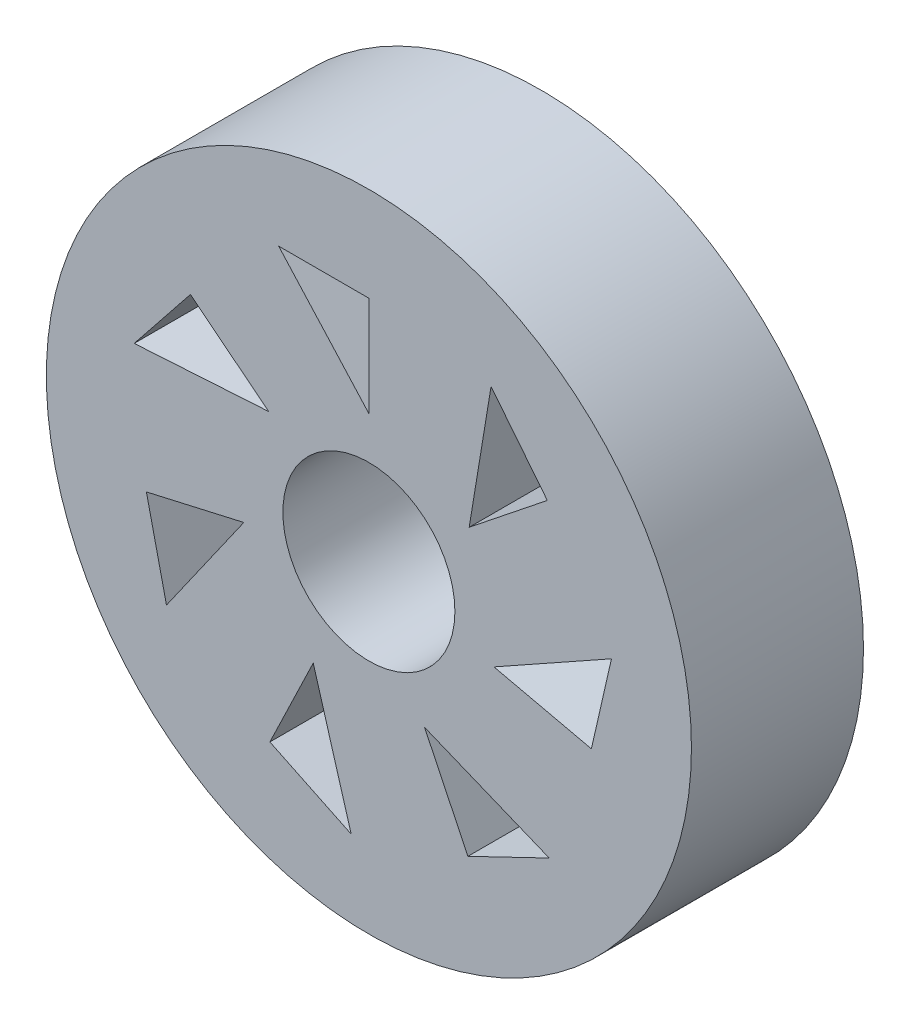
ISO-10303-21;
HEADER;
FILE_DESCRIPTION(('STEP AP214'),'2;1');
FILE_NAME('part.step','',(''),(''),'','','');
FILE_SCHEMA(('AUTOMOTIVE_DESIGN { 1 0 10303 214 1 1 1 1 }'));
ENDSEC;
DATA;
#1=APPLICATION_CONTEXT('core data for automotive mechanical design processes');
#2=APPLICATION_PROTOCOL_DEFINITION('international standard','automotive_design',2000,#1);
#3=PRODUCT_CONTEXT('',#1,'mechanical');
#4=PRODUCT('Part','Part','',(#3));
#5=PRODUCT_RELATED_PRODUCT_CATEGORY('part','',(#4));
#6=PRODUCT_DEFINITION_FORMATION('','',#4);
#7=PRODUCT_DEFINITION_CONTEXT('part definition',#1,'design');
#8=PRODUCT_DEFINITION('design','',#6,#7);
#9=PRODUCT_DEFINITION_SHAPE('','',#8);
#10=(LENGTH_UNIT() NAMED_UNIT(*) SI_UNIT(.MILLI.,.METRE.));
#11=(NAMED_UNIT(*) PLANE_ANGLE_UNIT() SI_UNIT($,.RADIAN.));
#12=(NAMED_UNIT(*) SI_UNIT($,.STERADIAN.) SOLID_ANGLE_UNIT());
#13=UNCERTAINTY_MEASURE_WITH_UNIT(LENGTH_MEASURE(1.E-05),#10,'distance_accuracy_value','');
#14=(GEOMETRIC_REPRESENTATION_CONTEXT(3) GLOBAL_UNCERTAINTY_ASSIGNED_CONTEXT((#13)) GLOBAL_UNIT_ASSIGNED_CONTEXT((#10,
#11,#12)) REPRESENTATION_CONTEXT('',''));
#15=CARTESIAN_POINT('',(0.,0.,0.));
#16=DIRECTION('',(0.,0.,1.));
#17=DIRECTION('',(1.,0.,0.));
#18=AXIS2_PLACEMENT_3D('',#15,#16,#17);
#19=CARTESIAN_POINT('',(-23.0042047893042,15.6099961070278,10.16));
#20=DIRECTION('',(0.,0.,1.));
#21=DIRECTION('',(1.,0.,0.));
#22=AXIS2_PLACEMENT_3D('',#19,#20,#21);
#23=PLANE('',#22);
#24=DIRECTION('',(0.998116427210059,0.0613481681342384,0.));
#25=VECTOR('',#24,1.);
#26=CARTESIAN_POINT('',(-28.9279019001569,20.3339869167322,10.16));
#27=LINE('',#26,#25);
#28=CARTESIAN_POINT('',(-36.8652069697175,19.8461288746586,10.16));
#29=VERTEX_POINT('',#28);
#30=CARTESIAN_POINT('',(-28.9279019001569,20.3339869167325,10.16));
#31=VERTEX_POINT('',#30);
#32=EDGE_CURVE('E71',#29,#31,#27,.T.);
#33=ORIENTED_EDGE('',*,*,#32,.F.);
#34=DIRECTION('',(-0.623489801858733,-0.78183148246803,0.));
#35=VECTOR('',#34,1.);
#36=CARTESIAN_POINT('',(-36.8652069697175,19.8461288746586,10.16));
#37=LINE('',#36,#35);
#38=CARTESIAN_POINT('',(-33.5418494923247,24.013487339184,10.16));
#39=VERTEX_POINT('',#38);
#40=EDGE_CURVE('E379',#39,#29,#37,.T.);
#41=ORIENTED_EDGE('',*,*,#40,.F.);
#42=DIRECTION('',(-0.78183148246803,0.623489801858733,0.));
#43=VECTOR('',#42,1.);
#44=CARTESIAN_POINT('',(-33.5418494923247,24.013487339184,10.16));
#45=LINE('',#44,#43);
#46=EDGE_CURVE('E390',#31,#39,#45,.T.);
#47=ORIENTED_EDGE('',*,*,#46,.F.);
#48=EDGE_LOOP('',(#33,#41,#47));
#49=FACE_BOUND('',#48,.T.);
#50=DIRECTION('',(0.574351484194065,0.818608803155741,0.));
#51=VECTOR('',#50,1.);
#52=CARTESIAN_POINT('',(-30.3909342651372,13.9240233070828,10.16));
#53=LINE('',#52,#51);
#54=CARTESIAN_POINT('',(-34.9583402539816,7.41421380375968,10.16));
#55=VERTEX_POINT('',#54);
#56=CARTESIAN_POINT('',(-30.3909342651372,13.9240233070837,10.16));
#57=VERTEX_POINT('',#56);
#58=EDGE_CURVE('E79',#55,#57,#53,.T.);
#59=ORIENTED_EDGE('',*,*,#58,.F.);
#60=DIRECTION('',(0.222520933956306,-0.974927912181826,0.));
#61=VECTOR('',#60,1.);
#62=CARTESIAN_POINT('',(-34.9583402539816,7.41421380375968,10.16));
#63=LINE('',#62,#61);
#64=CARTESIAN_POINT('',(-36.1444328051917,12.6108248104022,10.16));
#65=VERTEX_POINT('',#64);
#66=EDGE_CURVE('E348',#65,#55,#63,.T.);
#67=ORIENTED_EDGE('',*,*,#66,.F.);
#68=DIRECTION('',(-0.974927912181826,-0.222520933956305,0.));
#69=VECTOR('',#68,1.);
#70=CARTESIAN_POINT('',(-36.1444328051917,12.6108248104022,10.16));
#71=LINE('',#70,#69);
#72=EDGE_CURVE('E359',#57,#65,#71,.T.);
#73=ORIENTED_EDGE('',*,*,#72,.F.);
#74=EDGE_LOOP('',(#59,#67,#73));
#75=FACE_BOUND('',#74,.T.);
#76=DIRECTION('',(-0.281911841055207,0.959440312824546,0.));
#77=VECTOR('',#76,1.);
#78=CARTESIAN_POINT('',(-26.2916086729933,8.78363160336959,10.16));
#79=LINE('',#78,#77);
#80=CARTESIAN_POINT('',(-24.0497657134187,1.15388997071297,10.16));
#81=VERTEX_POINT('',#80);
#82=CARTESIAN_POINT('',(-26.2916086729947,8.78363160336959,10.16));
#83=VERTEX_POINT('',#82);
#84=EDGE_CURVE('E324',#81,#83,#79,.T.);
#85=ORIENTED_EDGE('',*,*,#84,.F.);
#86=DIRECTION('',(0.900968867902416,-0.433883739117565,0.));
#87=VECTOR('',#86,1.);
#88=CARTESIAN_POINT('',(-24.0497657134187,1.15388997071297,10.16));
#89=LINE('',#88,#87);
#90=CARTESIAN_POINT('',(-28.8521564102918,3.46659943992451,10.16));
#91=VERTEX_POINT('',#90);
#92=EDGE_CURVE('E315',#91,#81,#89,.T.);
#93=ORIENTED_EDGE('',*,*,#92,.F.);
#94=DIRECTION('',(-0.433883739117565,-0.900968867902416,0.));
#95=VECTOR('',#94,1.);
#96=CARTESIAN_POINT('',(-28.8521564102918,3.46659943992451,10.16));
#97=LINE('',#96,#95);
#98=EDGE_CURVE('E327',#83,#91,#97,.T.);
#99=ORIENTED_EDGE('',*,*,#98,.F.);
#100=EDGE_LOOP('',(#85,#93,#99));
#101=FACE_BOUND('',#100,.T.);
#102=DIRECTION('',(-0.925889800036348,0.377793697920772,0.));
#103=VECTOR('',#102,1.);
#104=CARTESIAN_POINT('',(-19.7168009056126,8.7836316033701,10.16));
#105=LINE('',#104,#103);
#106=CARTESIAN_POINT('',(-12.3538624714411,5.77930890913646,10.16));
#107=VERTEX_POINT('',#106);
#108=CARTESIAN_POINT('',(-19.716800905614,8.7836316033701,10.16));
#109=VERTEX_POINT('',#108);
#110=EDGE_CURVE('E291',#107,#109,#105,.T.);
#111=ORIENTED_EDGE('',*,*,#110,.F.);
#112=DIRECTION('',(0.900968867902422,0.433883739117553,0.));
#113=VECTOR('',#112,1.);
#114=CARTESIAN_POINT('',(-12.3538624714411,5.77930890913646,10.16));
#115=LINE('',#114,#113);
#116=CARTESIAN_POINT('',(-17.1562531683142,3.46659943992498,10.16));
#117=VERTEX_POINT('',#116);
#118=EDGE_CURVE('E282',#117,#107,#115,.T.);
#119=ORIENTED_EDGE('',*,*,#118,.F.);
#120=DIRECTION('',(0.433883739117553,-0.900968867902422,0.));
#121=VECTOR('',#120,1.);
#122=CARTESIAN_POINT('',(-17.1562531683142,3.46659943992498,10.16));
#123=LINE('',#122,#121);
#124=EDGE_CURVE('E294',#109,#117,#123,.T.);
#125=ORIENTED_EDGE('',*,*,#124,.F.);
#126=EDGE_LOOP('',(#111,#119,#125));
#127=FACE_BOUND('',#126,.T.);
#128=DIRECTION('',(-0.87265385488016,-0.488339277104347,0.));
#129=VECTOR('',#128,1.);
#130=CARTESIAN_POINT('',(-15.6174753134696,13.924023307084,10.16));
#131=LINE('',#130,#129);
#132=CARTESIAN_POINT('',(-8.67788422220488,17.8074358170458,10.16));
#133=VERTEX_POINT('',#132);
#134=CARTESIAN_POINT('',(-15.6174753134696,13.9240233070832,10.16));
#135=VERTEX_POINT('',#134);
#136=EDGE_CURVE('E258',#133,#135,#131,.T.);
#137=ORIENTED_EDGE('',*,*,#136,.F.);
#138=DIRECTION('',(0.222520933956319,0.974927912181823,0.));
#139=VECTOR('',#138,1.);
#140=CARTESIAN_POINT('',(-8.67788422220488,17.8074358170458,10.16));
#141=LINE('',#140,#139);
#142=CARTESIAN_POINT('',(-9.86397677341508,12.6108248104033,10.16));
#143=VERTEX_POINT('',#142);
#144=EDGE_CURVE('E249',#143,#133,#141,.T.);
#145=ORIENTED_EDGE('',*,*,#144,.F.);
#146=DIRECTION('',(0.974927912181823,-0.222520933956318,0.));
#147=VECTOR('',#146,1.);
#148=CARTESIAN_POINT('',(-9.86397677341508,12.6108248104033,10.16));
#149=LINE('',#148,#147);
#150=EDGE_CURVE('E261',#135,#143,#149,.T.);
#151=ORIENTED_EDGE('',*,*,#150,.F.);
#152=EDGE_LOOP('',(#137,#145,#151));
#153=FACE_BOUND('',#152,.T.);
#154=DIRECTION('',(-0.162291758104631,-0.986742816164023,0.));
#155=VECTOR('',#154,1.);
#156=CARTESIAN_POINT('',(-17.0805076784509,20.3339869167332,10.16));
#157=LINE('',#156,#155);
#158=CARTESIAN_POINT('',(-15.789917563676,28.1808458037104,10.16));
#159=VERTEX_POINT('',#158);
#160=CARTESIAN_POINT('',(-17.0805076784509,20.3339869167329,10.16));
#161=VERTEX_POINT('',#160);
#162=EDGE_CURVE('E206',#159,#161,#157,.T.);
#163=ORIENTED_EDGE('',*,*,#162,.F.);
#164=DIRECTION('',(-0.623489801858731,0.781831482468031,0.));
#165=VECTOR('',#164,1.);
#166=CARTESIAN_POINT('',(-15.789917563676,28.1808458037104,10.16));
#167=LINE('',#166,#165);
#168=CARTESIAN_POINT('',(-12.4665600862831,24.013487339185,10.16));
#169=VERTEX_POINT('',#168);
#170=EDGE_CURVE('E224',#169,#159,#167,.T.);
#171=ORIENTED_EDGE('',*,*,#170,.F.);
#172=DIRECTION('',(0.781831482468032,0.623489801858731,0.));
#173=VECTOR('',#172,1.);
#174=CARTESIAN_POINT('',(-12.4665600862831,24.013487339185,10.16));
#175=LINE('',#174,#173);
#176=EDGE_CURVE('E228',#161,#169,#175,.T.);
#177=ORIENTED_EDGE('',*,*,#176,.F.);
#178=EDGE_LOOP('',(#163,#171,#177));
#179=FACE_BOUND('',#178,.T.);
#180=DIRECTION('',(0.,1.,0.));
#181=VECTOR('',#180,1.);
#182=CARTESIAN_POINT('',(-23.0042047893042,29.0881495701709,10.16));
#183=LINE('',#182,#181);
#184=CARTESIAN_POINT('',(-23.0042047893042,23.186689094823,10.16));
#185=VERTEX_POINT('',#184);
#186=CARTESIAN_POINT('',(-23.0042047893042,29.0881495701709,10.16));
#187=VERTEX_POINT('',#186);
#188=EDGE_CURVE('E241',#185,#187,#183,.T.);
#189=ORIENTED_EDGE('',*,*,#188,.F.);
#190=DIRECTION('',(0.670279342672237,-0.742108888766921,0.));
#191=VECTOR('',#190,1.);
#192=CARTESIAN_POINT('',(-23.0042047893042,23.186689094823,10.16));
#193=LINE('',#192,#191);
#194=CARTESIAN_POINT('',(-28.3344563306851,29.0881495701709,10.16));
#195=VERTEX_POINT('',#194);
#196=EDGE_CURVE('E409',#195,#185,#193,.T.);
#197=ORIENTED_EDGE('',*,*,#196,.F.);
#198=DIRECTION('',(-1.,0.,0.));
#199=VECTOR('',#198,1.);
#200=CARTESIAN_POINT('',(-28.3344563306851,29.0881495701709,10.16));
#201=LINE('',#200,#199);
#202=EDGE_CURVE('E420',#187,#195,#201,.T.);
#203=ORIENTED_EDGE('',*,*,#202,.F.);
#204=EDGE_LOOP('',(#189,#197,#203));
#205=FACE_BOUND('',#204,.T.);
#206=CARTESIAN_POINT('',(-23.0042047893042,15.6099961070278,10.16));
#207=DIRECTION('',(0.,0.,1.));
#208=DIRECTION('',(1.,0.,0.));
#209=AXIS2_PLACEMENT_3D('',#206,#207,#208);
#210=CIRCLE('',#209,19.05);
#211=CARTESIAN_POINT('',(-3.95420478930416,15.6099961070278,10.16));
#212=VERTEX_POINT('',#211);
#213=EDGE_CURVE('E13',#212,#212,#210,.T.);
#214=ORIENTED_EDGE('',*,*,#213,.T.);
#215=EDGE_LOOP('',(#214));
#216=FACE_BOUND('',#215,.T.);
#217=CARTESIAN_POINT('',(-23.0042047893042,15.6099961070278,10.16));
#218=DIRECTION('',(0.,0.,1.));
#219=DIRECTION('',(1.,0.,0.));
#220=AXIS2_PLACEMENT_3D('',#217,#218,#219);
#221=CIRCLE('',#220,5.08);
#222=CARTESIAN_POINT('',(-17.9242047893042,15.6099961070278,10.16));
#223=VERTEX_POINT('',#222);
#224=EDGE_CURVE('E437',#223,#223,#221,.T.);
#225=ORIENTED_EDGE('',*,*,#224,.F.);
#226=EDGE_LOOP('',(#225));
#227=FACE_BOUND('',#226,.T.);
#228=ADVANCED_FACE('F55',(#49,#75,#101,#127,#153,#179,#205,#216,#227),#23,.T.);
#229=CARTESIAN_POINT('',(-23.0042047893042,15.6099961070278,0.));
#230=DIRECTION('',(0.,0.,1.));
#231=DIRECTION('',(1.,0.,0.));
#232=AXIS2_PLACEMENT_3D('',#229,#230,#231);
#233=PLANE('',#232);
#234=DIRECTION('',(-0.623489801858733,-0.78183148246803,0.));
#235=VECTOR('',#234,1.);
#236=CARTESIAN_POINT('',(-36.8652069697175,19.8461288746586,0.));
#237=LINE('',#236,#235);
#238=CARTESIAN_POINT('',(-33.5418494923247,24.0134873391843,0.));
#239=VERTEX_POINT('',#238);
#240=CARTESIAN_POINT('',(-36.8652069697175,19.8461288746586,0.));
#241=VERTEX_POINT('',#240);
#242=EDGE_CURVE('E383',#239,#241,#237,.T.);
#243=ORIENTED_EDGE('',*,*,#242,.T.);
#244=DIRECTION('',(0.998116427210059,0.0613481681342384,0.));
#245=VECTOR('',#244,1.);
#246=CARTESIAN_POINT('',(-28.9279019001569,20.3339869167322,0.));
#247=LINE('',#246,#245);
#248=CARTESIAN_POINT('',(-28.9279019001569,20.3339869167322,0.));
#249=VERTEX_POINT('',#248);
#250=EDGE_CURVE('E374',#241,#249,#247,.T.);
#251=ORIENTED_EDGE('',*,*,#250,.T.);
#252=DIRECTION('',(-0.78183148246803,0.623489801858733,0.));
#253=VECTOR('',#252,1.);
#254=CARTESIAN_POINT('',(-33.5418494923247,24.013487339184,0.));
#255=LINE('',#254,#253);
#256=EDGE_CURVE('E378',#249,#239,#255,.T.);
#257=ORIENTED_EDGE('',*,*,#256,.T.);
#258=EDGE_LOOP('',(#243,#251,#257));
#259=FACE_BOUND('',#258,.T.);
#260=DIRECTION('',(0.222520933956306,-0.974927912181826,0.));
#261=VECTOR('',#260,1.);
#262=CARTESIAN_POINT('',(-34.9583402539816,7.41421380375968,0.));
#263=LINE('',#262,#261);
#264=CARTESIAN_POINT('',(-36.1444328051917,12.610824810403,0.));
#265=VERTEX_POINT('',#264);
#266=CARTESIAN_POINT('',(-34.9583402539816,7.41421380375968,0.));
#267=VERTEX_POINT('',#266);
#268=EDGE_CURVE('E352',#265,#267,#263,.T.);
#269=ORIENTED_EDGE('',*,*,#268,.T.);
#270=DIRECTION('',(0.574351484194065,0.818608803155741,0.));
#271=VECTOR('',#270,1.);
#272=CARTESIAN_POINT('',(-30.3909342651372,13.9240233070828,0.));
#273=LINE('',#272,#271);
#274=CARTESIAN_POINT('',(-30.3909342651372,13.9240233070828,0.));
#275=VERTEX_POINT('',#274);
#276=EDGE_CURVE('E343',#267,#275,#273,.T.);
#277=ORIENTED_EDGE('',*,*,#276,.T.);
#278=DIRECTION('',(-0.974927912181826,-0.222520933956305,0.));
#279=VECTOR('',#278,1.);
#280=CARTESIAN_POINT('',(-36.1444328051917,12.6108248104022,0.));
#281=LINE('',#280,#279);
#282=EDGE_CURVE('E347',#275,#265,#281,.T.);
#283=ORIENTED_EDGE('',*,*,#282,.T.);
#284=EDGE_LOOP('',(#269,#277,#283));
#285=FACE_BOUND('',#284,.T.);
#286=DIRECTION('',(0.900968867902416,-0.433883739117565,0.));
#287=VECTOR('',#286,1.);
#288=CARTESIAN_POINT('',(-24.0497657134187,1.15388997071297,0.));
#289=LINE('',#288,#287);
#290=CARTESIAN_POINT('',(-28.8521564102932,3.46659943992451,0.));
#291=VERTEX_POINT('',#290);
#292=CARTESIAN_POINT('',(-24.0497657134187,1.15388997071297,0.));
#293=VERTEX_POINT('',#292);
#294=EDGE_CURVE('E319',#291,#293,#289,.T.);
#295=ORIENTED_EDGE('',*,*,#294,.T.);
#296=DIRECTION('',(-0.281911841055207,0.959440312824546,0.));
#297=VECTOR('',#296,1.);
#298=CARTESIAN_POINT('',(-26.2916086729933,8.78363160336959,0.));
#299=LINE('',#298,#297);
#300=CARTESIAN_POINT('',(-26.2916086729933,8.78363160336959,0.));
#301=VERTEX_POINT('',#300);
#302=EDGE_CURVE('E310',#293,#301,#299,.T.);
#303=ORIENTED_EDGE('',*,*,#302,.T.);
#304=DIRECTION('',(-0.433883739117565,-0.900968867902416,0.));
#305=VECTOR('',#304,1.);
#306=CARTESIAN_POINT('',(-28.8521564102918,3.46659943992451,0.));
#307=LINE('',#306,#305);
#308=EDGE_CURVE('E314',#301,#291,#307,.T.);
#309=ORIENTED_EDGE('',*,*,#308,.T.);
#310=EDGE_LOOP('',(#295,#303,#309));
#311=FACE_BOUND('',#310,.T.);
#312=DIRECTION('',(0.900968867902422,0.433883739117553,0.));
#313=VECTOR('',#312,1.);
#314=CARTESIAN_POINT('',(-12.3538624714411,5.77930890913646,0.));
#315=LINE('',#314,#313);
#316=CARTESIAN_POINT('',(-17.1562531683156,3.46659943992498,0.));
#317=VERTEX_POINT('',#316);
#318=CARTESIAN_POINT('',(-12.3538624714411,5.77930890913646,0.));
#319=VERTEX_POINT('',#318);
#320=EDGE_CURVE('E286',#317,#319,#315,.T.);
#321=ORIENTED_EDGE('',*,*,#320,.T.);
#322=DIRECTION('',(-0.925889800036348,0.377793697920772,0.));
#323=VECTOR('',#322,1.);
#324=CARTESIAN_POINT('',(-19.7168009056126,8.7836316033701,0.));
#325=LINE('',#324,#323);
#326=CARTESIAN_POINT('',(-19.7168009056126,8.7836316033701,0.));
#327=VERTEX_POINT('',#326);
#328=EDGE_CURVE('E277',#319,#327,#325,.T.);
#329=ORIENTED_EDGE('',*,*,#328,.T.);
#330=DIRECTION('',(0.433883739117553,-0.900968867902422,0.));
#331=VECTOR('',#330,1.);
#332=CARTESIAN_POINT('',(-17.1562531683142,3.46659943992498,0.));
#333=LINE('',#332,#331);
#334=EDGE_CURVE('E281',#327,#317,#333,.T.);
#335=ORIENTED_EDGE('',*,*,#334,.T.);
#336=EDGE_LOOP('',(#321,#329,#335));
#337=FACE_BOUND('',#336,.T.);
#338=DIRECTION('',(0.222520933956319,0.974927912181823,0.));
#339=VECTOR('',#338,1.);
#340=CARTESIAN_POINT('',(-8.67788422220488,17.8074358170458,0.));
#341=LINE('',#340,#339);
#342=CARTESIAN_POINT('',(-9.86397677341508,12.6108248104025,0.));
#343=VERTEX_POINT('',#342);
#344=CARTESIAN_POINT('',(-8.67788422220488,17.8074358170458,0.));
#345=VERTEX_POINT('',#344);
#346=EDGE_CURVE('E253',#343,#345,#341,.T.);
#347=ORIENTED_EDGE('',*,*,#346,.T.);
#348=DIRECTION('',(-0.87265385488016,-0.488339277104347,0.));
#349=VECTOR('',#348,1.);
#350=CARTESIAN_POINT('',(-15.6174753134696,13.924023307084,0.));
#351=LINE('',#350,#349);
#352=CARTESIAN_POINT('',(-15.6174753134696,13.924023307084,0.));
#353=VERTEX_POINT('',#352);
#354=EDGE_CURVE('E244',#345,#353,#351,.T.);
#355=ORIENTED_EDGE('',*,*,#354,.T.);
#356=DIRECTION('',(0.974927912181823,-0.222520933956318,0.));
#357=VECTOR('',#356,1.);
#358=CARTESIAN_POINT('',(-9.86397677341508,12.6108248104033,0.));
#359=LINE('',#358,#357);
#360=EDGE_CURVE('E248',#353,#343,#359,.T.);
#361=ORIENTED_EDGE('',*,*,#360,.T.);
#362=EDGE_LOOP('',(#347,#355,#361));
#363=FACE_BOUND('',#362,.T.);
#364=DIRECTION('',(-0.623489801858731,0.781831482468031,0.));
#365=VECTOR('',#364,1.);
#366=CARTESIAN_POINT('',(-15.789917563676,28.1808458037104,0.));
#367=LINE('',#366,#365);
#368=CARTESIAN_POINT('',(-12.4665600862831,24.0134873391847,0.));
#369=VERTEX_POINT('',#368);
#370=CARTESIAN_POINT('',(-15.789917563676,28.1808458037104,0.));
#371=VERTEX_POINT('',#370);
#372=EDGE_CURVE('E212',#369,#371,#367,.T.);
#373=ORIENTED_EDGE('',*,*,#372,.T.);
#374=DIRECTION('',(-0.162291758104631,-0.986742816164023,0.));
#375=VECTOR('',#374,1.);
#376=CARTESIAN_POINT('',(-17.0805076784509,20.3339869167332,0.));
#377=LINE('',#376,#375);
#378=CARTESIAN_POINT('',(-17.0805076784509,20.3339869167332,0.));
#379=VERTEX_POINT('',#378);
#380=EDGE_CURVE('E203',#371,#379,#377,.T.);
#381=ORIENTED_EDGE('',*,*,#380,.T.);
#382=DIRECTION('',(0.781831482468032,0.623489801858731,0.));
#383=VECTOR('',#382,1.);
#384=CARTESIAN_POINT('',(-12.4665600862831,24.013487339185,0.));
#385=LINE('',#384,#383);
#386=EDGE_CURVE('E216',#379,#369,#385,.T.);
#387=ORIENTED_EDGE('',*,*,#386,.T.);
#388=EDGE_LOOP('',(#373,#381,#387));
#389=FACE_BOUND('',#388,.T.);
#390=DIRECTION('',(0.670279342672237,-0.742108888766921,0.));
#391=VECTOR('',#390,1.);
#392=CARTESIAN_POINT('',(-23.0042047893042,23.186689094823,0.));
#393=LINE('',#392,#391);
#394=CARTESIAN_POINT('',(-28.3344563306851,29.0881495701709,0.));
#395=VERTEX_POINT('',#394);
#396=CARTESIAN_POINT('',(-23.0042047893042,23.186689094823,0.));
#397=VERTEX_POINT('',#396);
#398=EDGE_CURVE('E413',#395,#397,#393,.T.);
#399=ORIENTED_EDGE('',*,*,#398,.T.);
#400=DIRECTION('',(0.,1.,0.));
#401=VECTOR('',#400,1.);
#402=CARTESIAN_POINT('',(-23.0042047893042,29.0881495701709,0.));
#403=LINE('',#402,#401);
#404=CARTESIAN_POINT('',(-23.0042047893042,29.0881495701709,0.));
#405=VERTEX_POINT('',#404);
#406=EDGE_CURVE('E404',#397,#405,#403,.T.);
#407=ORIENTED_EDGE('',*,*,#406,.T.);
#408=DIRECTION('',(-1.,0.,0.));
#409=VECTOR('',#408,1.);
#410=CARTESIAN_POINT('',(-28.3344563306851,29.0881495701709,0.));
#411=LINE('',#410,#409);
#412=EDGE_CURVE('E408',#405,#395,#411,.T.);
#413=ORIENTED_EDGE('',*,*,#412,.T.);
#414=EDGE_LOOP('',(#399,#407,#413));
#415=FACE_BOUND('',#414,.T.);
#416=CARTESIAN_POINT('',(-23.0042047893042,15.6099961070278,0.));
#417=DIRECTION('',(0.,0.,1.));
#418=DIRECTION('',(1.,0.,0.));
#419=AXIS2_PLACEMENT_3D('',#416,#417,#418);
#420=CIRCLE('',#419,19.05);
#421=CARTESIAN_POINT('',(-3.95420478930416,15.6099961070278,0.));
#422=VERTEX_POINT('',#421);
#423=EDGE_CURVE('E59',#422,#422,#420,.T.);
#424=ORIENTED_EDGE('',*,*,#423,.F.);
#425=EDGE_LOOP('',(#424));
#426=FACE_BOUND('',#425,.T.);
#427=CARTESIAN_POINT('',(-23.0042047893042,15.6099961070278,0.));
#428=DIRECTION('',(0.,0.,1.));
#429=DIRECTION('',(1.,0.,0.));
#430=AXIS2_PLACEMENT_3D('',#427,#428,#429);
#431=CIRCLE('',#430,5.08);
#432=CARTESIAN_POINT('',(-17.9242047893042,15.6099961070278,0.));
#433=VERTEX_POINT('',#432);
#434=EDGE_CURVE('E430',#433,#433,#431,.T.);
#435=ORIENTED_EDGE('',*,*,#434,.T.);
#436=EDGE_LOOP('',(#435));
#437=FACE_BOUND('',#436,.T.);
#438=ADVANCED_FACE('F221',(#259,#285,#311,#337,#363,#389,#415,#426,#437),#233,.F.);
#439=CARTESIAN_POINT('',(-23.0042047893042,15.6099961070278,10.16));
#440=DIRECTION('',(0.,0.,-1.));
#441=DIRECTION('',(-1.,0.,0.));
#442=AXIS2_PLACEMENT_3D('',#439,#440,#441);
#443=CYLINDRICAL_SURFACE('',#442,19.05);
#444=ORIENTED_EDGE('',*,*,#213,.F.);
#445=EDGE_LOOP('',(#444));
#446=FACE_BOUND('',#445,.T.);
#447=ORIENTED_EDGE('',*,*,#423,.T.);
#448=EDGE_LOOP('',(#447));
#449=FACE_BOUND('',#448,.T.);
#450=ADVANCED_FACE('F57',(#446,#449),#443,.T.);
#451=CARTESIAN_POINT('',(-23.0042047893042,15.6099961070278,10.16));
#452=DIRECTION('',(0.,0.,-1.));
#453=DIRECTION('',(-1.,0.,0.));
#454=AXIS2_PLACEMENT_3D('',#451,#452,#453);
#455=CYLINDRICAL_SURFACE('',#454,5.08);
#456=ORIENTED_EDGE('',*,*,#224,.T.);
#457=EDGE_LOOP('',(#456));
#458=FACE_BOUND('',#457,.T.);
#459=ORIENTED_EDGE('',*,*,#434,.F.);
#460=EDGE_LOOP('',(#459));
#461=FACE_BOUND('',#460,.T.);
#462=ADVANCED_FACE('F446',(#458,#461),#455,.F.);
#463=CARTESIAN_POINT('',(-23.0042047893042,29.0881495701709,0.));
#464=DIRECTION('',(1.,0.,0.));
#465=DIRECTION('',(0.,0.,-1.));
#466=AXIS2_PLACEMENT_3D('',#463,#464,#465);
#467=PLANE('',#466);
#468=ORIENTED_EDGE('',*,*,#188,.T.);
#469=DIRECTION('',(0.,0.,1.));
#470=VECTOR('',#469,1.);
#471=CARTESIAN_POINT('',(-23.0042047893042,29.0881495701709,0.));
#472=LINE('',#471,#470);
#473=EDGE_CURVE('E417',#405,#187,#472,.T.);
#474=ORIENTED_EDGE('',*,*,#473,.F.);
#475=ORIENTED_EDGE('',*,*,#406,.F.);
#476=DIRECTION('',(0.,0.,1.));
#477=VECTOR('',#476,1.);
#478=CARTESIAN_POINT('',(-23.0042047893042,23.186689094823,0.));
#479=LINE('',#478,#477);
#480=EDGE_CURVE('E427',#397,#185,#479,.T.);
#481=ORIENTED_EDGE('',*,*,#480,.T.);
#482=EDGE_LOOP('',(#468,#474,#475,#481));
#483=FACE_BOUND('',#482,.T.);
#484=ADVANCED_FACE('F448',(#483),#467,.F.);
#485=CARTESIAN_POINT('',(-23.0042047893042,23.186689094823,0.));
#486=DIRECTION('',(-0.742108888766921,-0.670279342672237,0.));
#487=DIRECTION('',(0.670279342672237,-0.742108888766921,0.));
#488=AXIS2_PLACEMENT_3D('',#485,#486,#487);
#489=PLANE('',#488);
#490=ORIENTED_EDGE('',*,*,#196,.T.);
#491=ORIENTED_EDGE('',*,*,#480,.F.);
#492=ORIENTED_EDGE('',*,*,#398,.F.);
#493=DIRECTION('',(0.,0.,1.));
#494=VECTOR('',#493,1.);
#495=CARTESIAN_POINT('',(-28.3344563306851,29.0881495701709,0.));
#496=LINE('',#495,#494);
#497=EDGE_CURVE('E431',#395,#195,#496,.T.);
#498=ORIENTED_EDGE('',*,*,#497,.T.);
#499=EDGE_LOOP('',(#490,#491,#492,#498));
#500=FACE_BOUND('',#499,.T.);
#501=ADVANCED_FACE('F455',(#500),#489,.F.);
#502=CARTESIAN_POINT('',(-28.3344563306851,29.0881495701709,0.));
#503=DIRECTION('',(0.,1.,0.));
#504=DIRECTION('',(0.,0.,1.));
#505=AXIS2_PLACEMENT_3D('',#502,#503,#504);
#506=PLANE('',#505);
#507=ORIENTED_EDGE('',*,*,#202,.T.);
#508=ORIENTED_EDGE('',*,*,#497,.F.);
#509=ORIENTED_EDGE('',*,*,#412,.F.);
#510=ORIENTED_EDGE('',*,*,#473,.T.);
#511=EDGE_LOOP('',(#507,#508,#509,#510));
#512=FACE_BOUND('',#511,.T.);
#513=ADVANCED_FACE('F501',(#512),#506,.F.);
#514=CARTESIAN_POINT('',(-17.0805076784509,20.3339869167332,0.));
#515=DIRECTION('',(-0.986742816164023,0.162291758104631,0.));
#516=DIRECTION('',(-0.162291758104631,-0.986742816164024,0.));
#517=AXIS2_PLACEMENT_3D('',#514,#515,#516);
#518=PLANE('',#517);
#519=ORIENTED_EDGE('',*,*,#162,.T.);
#520=DIRECTION('',(0.,0.,1.));
#521=VECTOR('',#520,1.);
#522=CARTESIAN_POINT('',(-17.0805076784509,20.3339869167332,0.));
#523=LINE('',#522,#521);
#524=EDGE_CURVE('E199',#379,#161,#523,.T.);
#525=ORIENTED_EDGE('',*,*,#524,.F.);
#526=ORIENTED_EDGE('',*,*,#380,.F.);
#527=DIRECTION('',(0.,0.,1.));
#528=VECTOR('',#527,1.);
#529=CARTESIAN_POINT('',(-15.789917563676,28.1808458037104,0.));
#530=LINE('',#529,#528);
#531=EDGE_CURVE('E238',#371,#159,#530,.T.);
#532=ORIENTED_EDGE('',*,*,#531,.T.);
#533=EDGE_LOOP('',(#519,#525,#526,#532));
#534=FACE_BOUND('',#533,.T.);
#535=ADVANCED_FACE('F201',(#534),#518,.F.);
#536=CARTESIAN_POINT('',(-15.789917563676,28.1808458037104,0.));
#537=DIRECTION('',(0.781831482468031,0.623489801858731,0.));
#538=DIRECTION('',(-0.623489801858731,0.781831482468031,0.));
#539=AXIS2_PLACEMENT_3D('',#536,#537,#538);
#540=PLANE('',#539);
#541=ORIENTED_EDGE('',*,*,#170,.T.);
#542=ORIENTED_EDGE('',*,*,#531,.F.);
#543=ORIENTED_EDGE('',*,*,#372,.F.);
#544=DIRECTION('',(0.,0.,1.));
#545=VECTOR('',#544,1.);
#546=CARTESIAN_POINT('',(-12.4665600862831,24.013487339185,0.));
#547=LINE('',#546,#545);
#548=EDGE_CURVE('E211',#369,#169,#547,.T.);
#549=ORIENTED_EDGE('',*,*,#548,.T.);
#550=EDGE_LOOP('',(#541,#542,#543,#549));
#551=FACE_BOUND('',#550,.T.);
#552=ADVANCED_FACE('F571',(#551),#540,.F.);
#553=CARTESIAN_POINT('',(-12.4665600862831,24.013487339185,0.));
#554=DIRECTION('',(0.623489801858731,-0.781831482468032,0.));
#555=DIRECTION('',(0.781831482468032,0.623489801858731,0.));
#556=AXIS2_PLACEMENT_3D('',#553,#554,#555);
#557=PLANE('',#556);
#558=ORIENTED_EDGE('',*,*,#176,.T.);
#559=ORIENTED_EDGE('',*,*,#548,.F.);
#560=ORIENTED_EDGE('',*,*,#386,.F.);
#561=ORIENTED_EDGE('',*,*,#524,.T.);
#562=EDGE_LOOP('',(#558,#559,#560,#561));
#563=FACE_BOUND('',#562,.T.);
#564=ADVANCED_FACE('F217',(#563),#557,.F.);
#565=CARTESIAN_POINT('',(-15.6174753134696,13.924023307084,0.));
#566=DIRECTION('',(-0.488339277104347,0.87265385488016,0.));
#567=DIRECTION('',(-0.87265385488016,-0.488339277104347,0.));
#568=AXIS2_PLACEMENT_3D('',#565,#566,#567);
#569=PLANE('',#568);
#570=ORIENTED_EDGE('',*,*,#136,.T.);
#571=DIRECTION('',(0.,0.,1.));
#572=VECTOR('',#571,1.);
#573=CARTESIAN_POINT('',(-15.6174753134696,13.924023307084,0.));
#574=LINE('',#573,#572);
#575=EDGE_CURVE('E257',#353,#135,#574,.T.);
#576=ORIENTED_EDGE('',*,*,#575,.F.);
#577=ORIENTED_EDGE('',*,*,#354,.F.);
#578=DIRECTION('',(0.,0.,1.));
#579=VECTOR('',#578,1.);
#580=CARTESIAN_POINT('',(-8.67788422220488,17.8074358170458,0.));
#581=LINE('',#580,#579);
#582=EDGE_CURVE('E235',#345,#133,#581,.T.);
#583=ORIENTED_EDGE('',*,*,#582,.T.);
#584=EDGE_LOOP('',(#570,#576,#577,#583));
#585=FACE_BOUND('',#584,.T.);
#586=ADVANCED_FACE('F558',(#585),#569,.F.);
#587=CARTESIAN_POINT('',(-8.67788422220488,17.8074358170458,0.));
#588=DIRECTION('',(0.974927912181823,-0.222520933956319,0.));
#589=DIRECTION('',(0.222520933956319,0.974927912181823,0.));
#590=AXIS2_PLACEMENT_3D('',#587,#588,#589);
#591=PLANE('',#590);
#592=ORIENTED_EDGE('',*,*,#144,.T.);
#593=ORIENTED_EDGE('',*,*,#582,.F.);
#594=ORIENTED_EDGE('',*,*,#346,.F.);
#595=DIRECTION('',(0.,0.,1.));
#596=VECTOR('',#595,1.);
#597=CARTESIAN_POINT('',(-9.86397677341508,12.6108248104033,0.));
#598=LINE('',#597,#596);
#599=EDGE_CURVE('E271',#343,#143,#598,.T.);
#600=ORIENTED_EDGE('',*,*,#599,.T.);
#601=EDGE_LOOP('',(#592,#593,#594,#600));
#602=FACE_BOUND('',#601,.T.);
#603=ADVANCED_FACE('F561',(#602),#591,.F.);
#604=CARTESIAN_POINT('',(-9.86397677341508,12.6108248104033,0.));
#605=DIRECTION('',(-0.222520933956318,-0.974927912181823,0.));
#606=DIRECTION('',(0.974927912181823,-0.222520933956318,0.));
#607=AXIS2_PLACEMENT_3D('',#604,#605,#606);
#608=PLANE('',#607);
#609=ORIENTED_EDGE('',*,*,#150,.T.);
#610=ORIENTED_EDGE('',*,*,#599,.F.);
#611=ORIENTED_EDGE('',*,*,#360,.F.);
#612=ORIENTED_EDGE('',*,*,#575,.T.);
#613=EDGE_LOOP('',(#609,#610,#611,#612));
#614=FACE_BOUND('',#613,.T.);
#615=ADVANCED_FACE('F550',(#614),#608,.F.);
#616=CARTESIAN_POINT('',(-19.7168009056126,8.7836316033701,0.));
#617=DIRECTION('',(0.377793697920772,0.925889800036348,0.));
#618=DIRECTION('',(-0.925889800036348,0.377793697920772,0.));
#619=AXIS2_PLACEMENT_3D('',#616,#617,#618);
#620=PLANE('',#619);
#621=ORIENTED_EDGE('',*,*,#110,.T.);
#622=DIRECTION('',(0.,0.,1.));
#623=VECTOR('',#622,1.);
#624=CARTESIAN_POINT('',(-19.7168009056126,8.7836316033701,0.));
#625=LINE('',#624,#623);
#626=EDGE_CURVE('E290',#327,#109,#625,.T.);
#627=ORIENTED_EDGE('',*,*,#626,.F.);
#628=ORIENTED_EDGE('',*,*,#328,.F.);
#629=DIRECTION('',(0.,0.,1.));
#630=VECTOR('',#629,1.);
#631=CARTESIAN_POINT('',(-12.3538624714411,5.77930890913646,0.));
#632=LINE('',#631,#630);
#633=EDGE_CURVE('E262',#319,#107,#632,.T.);
#634=ORIENTED_EDGE('',*,*,#633,.T.);
#635=EDGE_LOOP('',(#621,#627,#628,#634));
#636=FACE_BOUND('',#635,.T.);
#637=ADVANCED_FACE('F546',(#636),#620,.F.);
#638=CARTESIAN_POINT('',(-12.3538624714411,5.77930890913646,0.));
#639=DIRECTION('',(0.433883739117553,-0.900968867902422,0.));
#640=DIRECTION('',(0.900968867902422,0.433883739117553,0.));
#641=AXIS2_PLACEMENT_3D('',#638,#639,#640);
#642=PLANE('',#641);
#643=ORIENTED_EDGE('',*,*,#118,.T.);
#644=ORIENTED_EDGE('',*,*,#633,.F.);
#645=ORIENTED_EDGE('',*,*,#320,.F.);
#646=DIRECTION('',(0.,0.,1.));
#647=VECTOR('',#646,1.);
#648=CARTESIAN_POINT('',(-17.1562531683142,3.46659943992498,0.));
#649=LINE('',#648,#647);
#650=EDGE_CURVE('E304',#317,#117,#649,.T.);
#651=ORIENTED_EDGE('',*,*,#650,.T.);
#652=EDGE_LOOP('',(#643,#644,#645,#651));
#653=FACE_BOUND('',#652,.T.);
#654=ADVANCED_FACE('F549',(#653),#642,.F.);
#655=CARTESIAN_POINT('',(-17.1562531683142,3.46659943992498,0.));
#656=DIRECTION('',(-0.900968867902422,-0.433883739117553,0.));
#657=DIRECTION('',(0.433883739117553,-0.900968867902422,0.));
#658=AXIS2_PLACEMENT_3D('',#655,#656,#657);
#659=PLANE('',#658);
#660=ORIENTED_EDGE('',*,*,#124,.T.);
#661=ORIENTED_EDGE('',*,*,#650,.F.);
#662=ORIENTED_EDGE('',*,*,#334,.F.);
#663=ORIENTED_EDGE('',*,*,#626,.T.);
#664=EDGE_LOOP('',(#660,#661,#662,#663));
#665=FACE_BOUND('',#664,.T.);
#666=ADVANCED_FACE('F538',(#665),#659,.F.);
#667=CARTESIAN_POINT('',(-26.2916086729933,8.78363160336959,0.));
#668=DIRECTION('',(0.959440312824547,0.281911841055207,0.));
#669=DIRECTION('',(-0.281911841055207,0.959440312824547,0.));
#670=AXIS2_PLACEMENT_3D('',#667,#668,#669);
#671=PLANE('',#670);
#672=ORIENTED_EDGE('',*,*,#84,.T.);
#673=DIRECTION('',(0.,0.,1.));
#674=VECTOR('',#673,1.);
#675=CARTESIAN_POINT('',(-26.2916086729933,8.78363160336959,0.));
#676=LINE('',#675,#674);
#677=EDGE_CURVE('E323',#301,#83,#676,.T.);
#678=ORIENTED_EDGE('',*,*,#677,.F.);
#679=ORIENTED_EDGE('',*,*,#302,.F.);
#680=DIRECTION('',(0.,0.,1.));
#681=VECTOR('',#680,1.);
#682=CARTESIAN_POINT('',(-24.0497657134187,1.15388997071297,0.));
#683=LINE('',#682,#681);
#684=EDGE_CURVE('E295',#293,#81,#683,.T.);
#685=ORIENTED_EDGE('',*,*,#684,.T.);
#686=EDGE_LOOP('',(#672,#678,#679,#685));
#687=FACE_BOUND('',#686,.T.);
#688=ADVANCED_FACE('F534',(#687),#671,.F.);
#689=CARTESIAN_POINT('',(-24.0497657134187,1.15388997071297,0.));
#690=DIRECTION('',(-0.433883739117565,-0.900968867902416,0.));
#691=DIRECTION('',(0.900968867902416,-0.433883739117565,0.));
#692=AXIS2_PLACEMENT_3D('',#689,#690,#691);
#693=PLANE('',#692);
#694=ORIENTED_EDGE('',*,*,#92,.T.);
#695=ORIENTED_EDGE('',*,*,#684,.F.);
#696=ORIENTED_EDGE('',*,*,#294,.F.);
#697=DIRECTION('',(0.,0.,1.));
#698=VECTOR('',#697,1.);
#699=CARTESIAN_POINT('',(-28.8521564102918,3.46659943992451,0.));
#700=LINE('',#699,#698);
#701=EDGE_CURVE('E337',#291,#91,#700,.T.);
#702=ORIENTED_EDGE('',*,*,#701,.T.);
#703=EDGE_LOOP('',(#694,#695,#696,#702));
#704=FACE_BOUND('',#703,.T.);
#705=ADVANCED_FACE('F537',(#704),#693,.F.);
#706=CARTESIAN_POINT('',(-28.8521564102918,3.46659943992451,0.));
#707=DIRECTION('',(-0.900968867902416,0.433883739117565,0.));
#708=DIRECTION('',(-0.433883739117565,-0.900968867902416,0.));
#709=AXIS2_PLACEMENT_3D('',#706,#707,#708);
#710=PLANE('',#709);
#711=ORIENTED_EDGE('',*,*,#98,.T.);
#712=ORIENTED_EDGE('',*,*,#701,.F.);
#713=ORIENTED_EDGE('',*,*,#308,.F.);
#714=ORIENTED_EDGE('',*,*,#677,.T.);
#715=EDGE_LOOP('',(#711,#712,#713,#714));
#716=FACE_BOUND('',#715,.T.);
#717=ADVANCED_FACE('F527',(#716),#710,.F.);
#718=CARTESIAN_POINT('',(-30.3909342651372,13.9240233070828,0.));
#719=DIRECTION('',(0.818608803155741,-0.574351484194065,0.));
#720=DIRECTION('',(0.574351484194065,0.818608803155741,0.));
#721=AXIS2_PLACEMENT_3D('',#718,#719,#720);
#722=PLANE('',#721);
#723=ORIENTED_EDGE('',*,*,#58,.T.);
#724=DIRECTION('',(0.,0.,1.));
#725=VECTOR('',#724,1.);
#726=CARTESIAN_POINT('',(-30.3909342651372,13.9240233070828,0.));
#727=LINE('',#726,#725);
#728=EDGE_CURVE('E356',#275,#57,#727,.T.);
#729=ORIENTED_EDGE('',*,*,#728,.F.);
#730=ORIENTED_EDGE('',*,*,#276,.F.);
#731=DIRECTION('',(0.,0.,1.));
#732=VECTOR('',#731,1.);
#733=CARTESIAN_POINT('',(-34.9583402539816,7.41421380375968,0.));
#734=LINE('',#733,#732);
#735=EDGE_CURVE('E328',#267,#55,#734,.T.);
#736=ORIENTED_EDGE('',*,*,#735,.T.);
#737=EDGE_LOOP('',(#723,#729,#730,#736));
#738=FACE_BOUND('',#737,.T.);
#739=ADVANCED_FACE('F523',(#738),#722,.F.);
#740=CARTESIAN_POINT('',(-34.9583402539816,7.41421380375968,0.));
#741=DIRECTION('',(-0.974927912181826,-0.222520933956306,0.));
#742=DIRECTION('',(0.222520933956306,-0.974927912181826,0.));
#743=AXIS2_PLACEMENT_3D('',#740,#741,#742);
#744=PLANE('',#743);
#745=ORIENTED_EDGE('',*,*,#66,.T.);
#746=ORIENTED_EDGE('',*,*,#735,.F.);
#747=ORIENTED_EDGE('',*,*,#268,.F.);
#748=DIRECTION('',(0.,0.,1.));
#749=VECTOR('',#748,1.);
#750=CARTESIAN_POINT('',(-36.1444328051917,12.6108248104022,0.));
#751=LINE('',#750,#749);
#752=EDGE_CURVE('E369',#265,#65,#751,.T.);
#753=ORIENTED_EDGE('',*,*,#752,.T.);
#754=EDGE_LOOP('',(#745,#746,#747,#753));
#755=FACE_BOUND('',#754,.T.);
#756=ADVANCED_FACE('F526',(#755),#744,.F.);
#757=CARTESIAN_POINT('',(-36.1444328051917,12.6108248104022,0.));
#758=DIRECTION('',(-0.222520933956305,0.974927912181826,0.));
#759=DIRECTION('',(-0.974927912181826,-0.222520933956305,0.));
#760=AXIS2_PLACEMENT_3D('',#757,#758,#759);
#761=PLANE('',#760);
#762=ORIENTED_EDGE('',*,*,#72,.T.);
#763=ORIENTED_EDGE('',*,*,#752,.F.);
#764=ORIENTED_EDGE('',*,*,#282,.F.);
#765=ORIENTED_EDGE('',*,*,#728,.T.);
#766=EDGE_LOOP('',(#762,#763,#764,#765));
#767=FACE_BOUND('',#766,.T.);
#768=ADVANCED_FACE('F515',(#767),#761,.F.);
#769=CARTESIAN_POINT('',(-28.9279019001569,20.3339869167322,0.));
#770=DIRECTION('',(0.0613481681342384,-0.998116427210059,0.));
#771=DIRECTION('',(0.998116427210059,0.0613481681342384,0.));
#772=AXIS2_PLACEMENT_3D('',#769,#770,#771);
#773=PLANE('',#772);
#774=ORIENTED_EDGE('',*,*,#32,.T.);
#775=DIRECTION('',(0.,0.,1.));
#776=VECTOR('',#775,1.);
#777=CARTESIAN_POINT('',(-28.9279019001569,20.3339869167322,0.));
#778=LINE('',#777,#776);
#779=EDGE_CURVE('E387',#249,#31,#778,.T.);
#780=ORIENTED_EDGE('',*,*,#779,.F.);
#781=ORIENTED_EDGE('',*,*,#250,.F.);
#782=DIRECTION('',(0.,0.,1.));
#783=VECTOR('',#782,1.);
#784=CARTESIAN_POINT('',(-36.8652069697175,19.8461288746586,0.));
#785=LINE('',#784,#783);
#786=EDGE_CURVE('E360',#241,#29,#785,.T.);
#787=ORIENTED_EDGE('',*,*,#786,.T.);
#788=EDGE_LOOP('',(#774,#780,#781,#787));
#789=FACE_BOUND('',#788,.T.);
#790=ADVANCED_FACE('F511',(#789),#773,.F.);
#791=CARTESIAN_POINT('',(-36.8652069697175,19.8461288746586,0.));
#792=DIRECTION('',(-0.78183148246803,0.623489801858733,0.));
#793=DIRECTION('',(-0.623489801858733,-0.78183148246803,0.));
#794=AXIS2_PLACEMENT_3D('',#791,#792,#793);
#795=PLANE('',#794);
#796=ORIENTED_EDGE('',*,*,#40,.T.);
#797=ORIENTED_EDGE('',*,*,#786,.F.);
#798=ORIENTED_EDGE('',*,*,#242,.F.);
#799=DIRECTION('',(0.,0.,1.));
#800=VECTOR('',#799,1.);
#801=CARTESIAN_POINT('',(-33.5418494923247,24.013487339184,0.));
#802=LINE('',#801,#800);
#803=EDGE_CURVE('E399',#239,#39,#802,.T.);
#804=ORIENTED_EDGE('',*,*,#803,.T.);
#805=EDGE_LOOP('',(#796,#797,#798,#804));
#806=FACE_BOUND('',#805,.T.);
#807=ADVANCED_FACE('F514',(#806),#795,.F.);
#808=CARTESIAN_POINT('',(-33.5418494923247,24.013487339184,0.));
#809=DIRECTION('',(0.623489801858733,0.78183148246803,0.));
#810=DIRECTION('',(-0.78183148246803,0.623489801858733,0.));
#811=AXIS2_PLACEMENT_3D('',#808,#809,#810);
#812=PLANE('',#811);
#813=ORIENTED_EDGE('',*,*,#46,.T.);
#814=ORIENTED_EDGE('',*,*,#803,.F.);
#815=ORIENTED_EDGE('',*,*,#256,.F.);
#816=ORIENTED_EDGE('',*,*,#779,.T.);
#817=EDGE_LOOP('',(#813,#814,#815,#816));
#818=FACE_BOUND('',#817,.T.);
#819=ADVANCED_FACE('F516',(#818),#812,.F.);
#820=CLOSED_SHELL('',(#228,#438,#450,#462,#484,#501,#513,#535,#552,#564,#586,#603,#615,#637,
#654,#666,#688,#705,#717,#739,#756,#768,#790,#807,#819));
#821=MANIFOLD_SOLID_BREP('B2',#820);
#822=ADVANCED_BREP_SHAPE_REPRESENTATION('',(#18,#821),#14);
#823=SHAPE_DEFINITION_REPRESENTATION(#9,#822);
ENDSEC;
END-ISO-10303-21;
